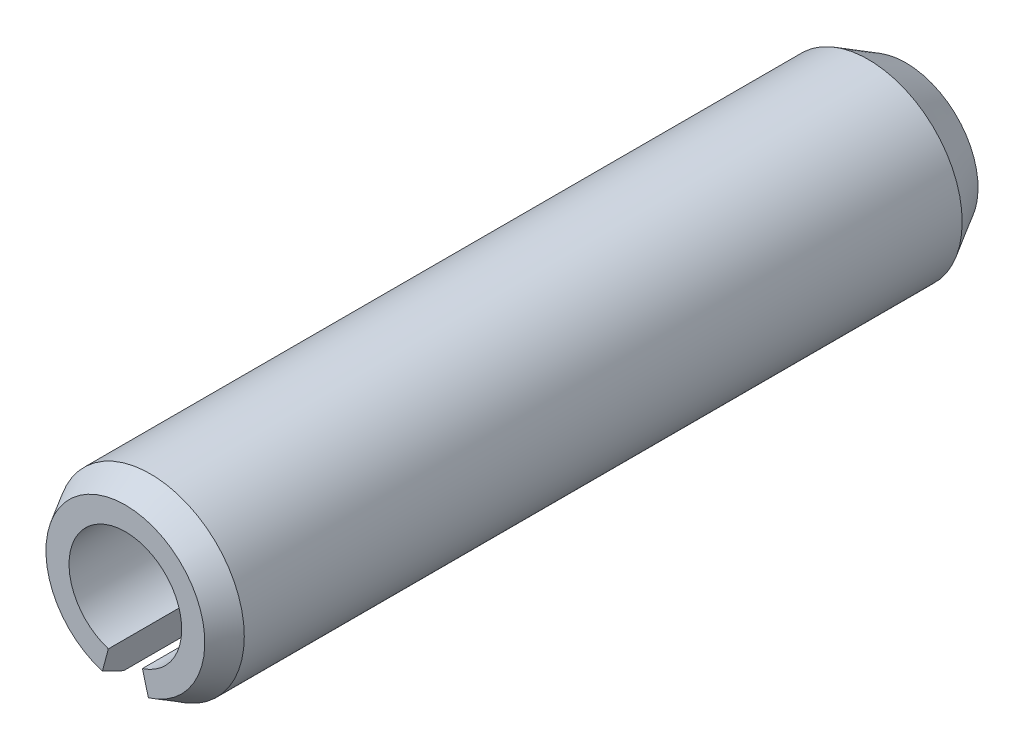
ISO-10303-21;
HEADER;
FILE_DESCRIPTION(('STEP AP214'),'2;1');
FILE_NAME('part.step','',(''),(''),'','','');
FILE_SCHEMA(('AUTOMOTIVE_DESIGN { 1 0 10303 214 1 1 1 1 }'));
ENDSEC;
DATA;
#1=APPLICATION_CONTEXT('core data for automotive mechanical design processes');
#2=APPLICATION_PROTOCOL_DEFINITION('international standard','automotive_design',2000,#1);
#3=PRODUCT_CONTEXT('',#1,'mechanical');
#4=PRODUCT('Part','Part','',(#3));
#5=PRODUCT_RELATED_PRODUCT_CATEGORY('part','',(#4));
#6=PRODUCT_DEFINITION_FORMATION('','',#4);
#7=PRODUCT_DEFINITION_CONTEXT('part definition',#1,'design');
#8=PRODUCT_DEFINITION('design','',#6,#7);
#9=PRODUCT_DEFINITION_SHAPE('','',#8);
#10=(LENGTH_UNIT() NAMED_UNIT(*) SI_UNIT(.MILLI.,.METRE.));
#11=(NAMED_UNIT(*) PLANE_ANGLE_UNIT() SI_UNIT($,.RADIAN.));
#12=(NAMED_UNIT(*) SI_UNIT($,.STERADIAN.) SOLID_ANGLE_UNIT());
#13=UNCERTAINTY_MEASURE_WITH_UNIT(LENGTH_MEASURE(1.E-05),#10,'distance_accuracy_value','');
#14=(GEOMETRIC_REPRESENTATION_CONTEXT(3) GLOBAL_UNCERTAINTY_ASSIGNED_CONTEXT((#13)) GLOBAL_UNIT_ASSIGNED_CONTEXT((#10,
#11,#12)) REPRESENTATION_CONTEXT('',''));
#15=CARTESIAN_POINT('',(0.,0.,0.));
#16=DIRECTION('',(0.,0.,1.));
#17=DIRECTION('',(1.,0.,0.));
#18=AXIS2_PLACEMENT_3D('',#15,#16,#17);
#19=CARTESIAN_POINT('',(0.,0.,25.));
#20=DIRECTION('',(0.,0.,-1.));
#21=DIRECTION('',(-1.,0.,0.));
#22=AXIS2_PLACEMENT_3D('',#19,#20,#21);
#23=CYLINDRICAL_SURFACE('',#22,3.);
#24=DIRECTION('',(0.,0.,-1.));
#25=VECTOR('',#24,1.);
#26=CARTESIAN_POINT('',(0.85488871162423,-2.8756156368224,25.));
#27=LINE('',#26,#25);
#28=CARTESIAN_POINT('',(0.85488871162423,-2.8756156368224,24.2));
#29=VERTEX_POINT('',#28);
#30=CARTESIAN_POINT('',(0.85488871162423,-2.8756156368224,1.26188021535174));
#31=VERTEX_POINT('',#30);
#32=EDGE_CURVE('E125',#29,#31,#27,.T.);
#33=ORIENTED_EDGE('',*,*,#32,.T.);
#34=CARTESIAN_POINT('',(0.,0.,1.26188021535174));
#35=DIRECTION('',(0.,0.,-1.));
#36=DIRECTION('',(-1.,0.,0.));
#37=AXIS2_PLACEMENT_3D('',#34,#35,#36);
#38=CIRCLE('',#37,3.);
#39=CARTESIAN_POINT('',(-0.85488871162424,-2.87561563682241,1.26188021535174));
#40=VERTEX_POINT('',#39);
#41=EDGE_CURVE('E174',#31,#40,#38,.F.);
#42=ORIENTED_EDGE('',*,*,#41,.T.);
#43=DIRECTION('',(0.,0.,-1.));
#44=VECTOR('',#43,1.);
#45=CARTESIAN_POINT('',(-0.85488871162424,-2.87561563682241,25.));
#46=LINE('',#45,#44);
#47=CARTESIAN_POINT('',(-0.85488871162424,-2.87561563682241,24.2));
#48=VERTEX_POINT('',#47);
#49=EDGE_CURVE('E104',#48,#40,#46,.T.);
#50=ORIENTED_EDGE('',*,*,#49,.F.);
#51=CARTESIAN_POINT('',(0.,0.,24.2));
#52=DIRECTION('',(0.,0.,1.));
#53=DIRECTION('',(1.,0.,0.));
#54=AXIS2_PLACEMENT_3D('',#51,#52,#53);
#55=CIRCLE('',#54,3.);
#56=EDGE_CURVE('E139',#48,#29,#55,.F.);
#57=ORIENTED_EDGE('',*,*,#56,.T.);
#58=EDGE_LOOP('',(#33,#42,#50,#57));
#59=FACE_BOUND('',#58,.T.);
#60=ADVANCED_FACE('F30',(#59),#23,.T.);
#61=CARTESIAN_POINT('',(-0.544114673264127,-1.71579113598909,25.));
#62=DIRECTION('',(0.965925826289069,-0.258819045102521,0.));
#63=DIRECTION('',(0.258819045102521,0.965925826289069,0.));
#64=AXIS2_PLACEMENT_3D('',#61,#62,#63);
#65=PLANE('',#64);
#66=ORIENTED_EDGE('',*,*,#49,.T.);
#67=CARTESIAN_POINT('',(-0.85488871162424,-2.87561563682241,1.26188021535174));
#68=CARTESIAN_POINT('',(-0.824991324845767,-2.76403707035159,1.06187394169725));
#69=CARTESIAN_POINT('',(-0.795092532536618,-2.65245325836889,0.861870804879628));
#70=CARTESIAN_POINT('',(-0.735292136851209,-2.42927514335823,0.461870804879614));
#71=CARTESIAN_POINT('',(-0.70539053347495,-2.31768084033027,0.261873941697224));
#72=CARTESIAN_POINT('',(-0.675487524568013,-2.20608129179042,0.061880215351702));
#73=B_SPLINE_CURVE_WITH_KNOTS('',3,(#67,#68,#69,#70,#71,#72),.UNSPECIFIED.,.F.,.F.,(4,2,4),(0.,
0.692903497274497,1.38580699468237),.UNSPECIFIED.);
#74=CARTESIAN_POINT('',(-0.675487524568013,-2.20608129179042,0.061880215351702));
#75=VERTEX_POINT('',#74);
#76=EDGE_CURVE('E58',#40,#75,#73,.T.);
#77=ORIENTED_EDGE('',*,*,#76,.T.);
#78=CARTESIAN_POINT('',(-0.85488871162424,-2.87561563682241,0.46188021535171));
#79=CARTESIAN_POINT('',(-0.820363465807382,-2.74676566529007,0.384891229899427));
#80=CARTESIAN_POINT('',(-0.785837551663028,-2.61791319952558,0.307906719233972));
#81=CARTESIAN_POINT('',(-0.716784386707371,-2.36020327948764,0.153946647450066));
#82=CARTESIAN_POINT('',(-0.682257135896068,-2.23134582521419,0.0769710863316175));
#83=CARTESIAN_POINT('',(-0.647729216757268,-2.10248587670857,0.));
#84=B_SPLINE_CURVE_WITH_KNOTS('',3,(#78,#79,#80,#81,#82,#83),.UNSPECIFIED.,.F.,.F.,(4,2,4),(0.,
0.462054654853131,0.924109309866234),.UNSPECIFIED.);
#85=CARTESIAN_POINT('',(-0.647729216757268,-2.10248587670857,0.));
#86=VERTEX_POINT('',#85);
#87=EDGE_CURVE('E109',#75,#86,#84,.T.);
#88=ORIENTED_EDGE('',*,*,#87,.T.);
#89=DIRECTION('',(-0.258819045102521,-0.965925826289069,0.));
#90=VECTOR('',#89,1.);
#91=CARTESIAN_POINT('',(-0.544114673264127,-1.71579113598909,0.));
#92=LINE('',#91,#90);
#93=CARTESIAN_POINT('',(-0.544114673264109,-1.71579113598908,0.));
#94=VERTEX_POINT('',#93);
#95=EDGE_CURVE('E108',#94,#86,#92,.T.);
#96=ORIENTED_EDGE('',*,*,#95,.F.);
#97=DIRECTION('',(0.,0.,-1.));
#98=VECTOR('',#97,1.);
#99=CARTESIAN_POINT('',(-0.544114673264109,-1.71579113598908,25.));
#100=LINE('',#99,#98);
#101=CARTESIAN_POINT('',(-0.544114673264109,-1.71579113598908,25.));
#102=VERTEX_POINT('',#101);
#103=EDGE_CURVE('E94',#102,#94,#100,.T.);
#104=ORIENTED_EDGE('',*,*,#103,.F.);
#105=DIRECTION('',(-0.258819045102521,-0.965925826289069,0.));
#106=VECTOR('',#105,1.);
#107=CARTESIAN_POINT('',(-0.544114673264127,-1.71579113598909,25.));
#108=LINE('',#107,#106);
#109=CARTESIAN_POINT('',(-0.735293146523919,-2.42927891150812,25.));
#110=VERTEX_POINT('',#109);
#111=EDGE_CURVE('E117',#102,#110,#108,.T.);
#112=ORIENTED_EDGE('',*,*,#111,.T.);
#113=CARTESIAN_POINT('',(-0.735293146523919,-2.42927891150812,25.));
#114=CARTESIAN_POINT('',(-0.755226828903657,-2.50367242693122,24.866669095173));
#115=CARTESIAN_POINT('',(-0.775159967185426,-2.57806391175306,24.7333369760914));
#116=CARTESIAN_POINT('',(-0.815025155552199,-2.72684282019116,24.4666703094247));
#117=CARTESIAN_POINT('',(-0.834957205637204,-2.80123024380741,24.3333357618396));
#118=CARTESIAN_POINT('',(-0.85488871162424,-2.87561563682241,24.2));
#119=B_SPLINE_CURVE_WITH_KNOTS('',3,(#113,#114,#115,#116,#117,#118),.UNSPECIFIED.,.F.,.F.,(4,2,
4),(0.,0.46193061486643,0.923861229713709),.UNSPECIFIED.);
#120=EDGE_CURVE('E133',#110,#48,#119,.T.);
#121=ORIENTED_EDGE('',*,*,#120,.T.);
#122=EDGE_LOOP('',(#66,#77,#88,#96,#104,#112,#121));
#123=FACE_BOUND('',#122,.T.);
#124=ADVANCED_FACE('F32',(#123),#65,.T.);
#125=CARTESIAN_POINT('',(0.,0.,25.));
#126=DIRECTION('',(0.,0.,-1.));
#127=DIRECTION('',(-1.,0.,0.));
#128=AXIS2_PLACEMENT_3D('',#125,#126,#127);
#129=CYLINDRICAL_SURFACE('',#128,1.8);
#130=DIRECTION('',(0.,0.,-1.));
#131=VECTOR('',#130,1.);
#132=CARTESIAN_POINT('',(0.544114673264102,-1.71579113598908,25.));
#133=LINE('',#132,#131);
#134=CARTESIAN_POINT('',(0.544114673264102,-1.71579113598908,25.));
#135=VERTEX_POINT('',#134);
#136=CARTESIAN_POINT('',(0.544114673264102,-1.71579113598908,0.));
#137=VERTEX_POINT('',#136);
#138=EDGE_CURVE('E105',#135,#137,#133,.T.);
#139=ORIENTED_EDGE('',*,*,#138,.F.);
#140=CARTESIAN_POINT('',(0.,0.,25.));
#141=DIRECTION('',(0.,0.,1.));
#142=DIRECTION('',(1.,0.,0.));
#143=AXIS2_PLACEMENT_3D('',#140,#141,#142);
#144=CIRCLE('',#143,1.8);
#145=EDGE_CURVE('E101',#135,#102,#144,.T.);
#146=ORIENTED_EDGE('',*,*,#145,.T.);
#147=ORIENTED_EDGE('',*,*,#103,.T.);
#148=CARTESIAN_POINT('',(0.,0.,0.));
#149=DIRECTION('',(0.,0.,1.));
#150=DIRECTION('',(1.,0.,0.));
#151=AXIS2_PLACEMENT_3D('',#148,#149,#150);
#152=CIRCLE('',#151,1.8);
#153=EDGE_CURVE('E98',#137,#94,#152,.T.);
#154=ORIENTED_EDGE('',*,*,#153,.F.);
#155=EDGE_LOOP('',(#139,#146,#147,#154));
#156=FACE_BOUND('',#155,.T.);
#157=ADVANCED_FACE('F96',(#156),#129,.F.);
#158=CARTESIAN_POINT('',(0.544114673264102,-1.71579113598908,25.));
#159=DIRECTION('',(0.965925826289068,0.258819045102521,0.));
#160=DIRECTION('',(-0.258819045102521,0.965925826289068,0.));
#161=AXIS2_PLACEMENT_3D('',#158,#159,#160);
#162=PLANE('',#161);
#163=CARTESIAN_POINT('',(0.647729216757258,-2.10248587670857,0.));
#164=CARTESIAN_POINT('',(0.68225713589605,-2.23134582521419,0.0769710863316155));
#165=CARTESIAN_POINT('',(0.716784386707349,-2.36020327948764,0.153946647450063));
#166=CARTESIAN_POINT('',(0.785837551663006,-2.61791319952558,0.307906719233969));
#167=CARTESIAN_POINT('',(0.820363465807364,-2.74676566529007,0.384891229899425));
#168=CARTESIAN_POINT('',(0.85488871162423,-2.8756156368224,0.46188021535171));
#169=B_SPLINE_CURVE_WITH_KNOTS('',3,(#163,#164,#165,#166,#167,#168),.UNSPECIFIED.,.F.,.F.,(4,2,
4),(0.,0.4620546550131,0.924109309866228),.UNSPECIFIED.);
#170=CARTESIAN_POINT('',(0.647729216757258,-2.10248587670857,0.));
#171=VERTEX_POINT('',#170);
#172=CARTESIAN_POINT('',(0.675487524568009,-2.20608129179042,0.061880215351702));
#173=VERTEX_POINT('',#172);
#174=EDGE_CURVE('E169',#171,#173,#169,.T.);
#175=ORIENTED_EDGE('',*,*,#174,.T.);
#176=CARTESIAN_POINT('',(0.675487524568009,-2.20608129179042,0.061880215351702));
#177=CARTESIAN_POINT('',(0.705390533474936,-2.31768084033027,0.261873941697223));
#178=CARTESIAN_POINT('',(0.735292136851189,-2.42927514335824,0.461870804879611));
#179=CARTESIAN_POINT('',(0.795092532536595,-2.6524532583689,0.861870804879625));
#180=CARTESIAN_POINT('',(0.824991324845749,-2.76403707035159,1.06187394169725));
#181=CARTESIAN_POINT('',(0.85488871162423,-2.8756156368224,1.26188021535174));
#182=B_SPLINE_CURVE_WITH_KNOTS('',3,(#176,#177,#178,#179,#180,#181),.UNSPECIFIED.,.F.,.F.,(4,2,
4),(0.,0.692903497407875,1.38580699468237),.UNSPECIFIED.);
#183=EDGE_CURVE('E11',#173,#31,#182,.T.);
#184=ORIENTED_EDGE('',*,*,#183,.T.);
#185=ORIENTED_EDGE('',*,*,#32,.F.);
#186=CARTESIAN_POINT('',(0.85488871162423,-2.8756156368224,24.2));
#187=CARTESIAN_POINT('',(0.834957205637186,-2.80123024380741,24.3333357618396));
#188=CARTESIAN_POINT('',(0.815025155552177,-2.72684282019116,24.4666703094247));
#189=CARTESIAN_POINT('',(0.775159967185405,-2.57806391175307,24.7333369760914));
#190=CARTESIAN_POINT('',(0.755226828903641,-2.50367242693122,24.866669095173));
#191=CARTESIAN_POINT('',(0.735293146523913,-2.42927891150811,25.));
#192=B_SPLINE_CURVE_WITH_KNOTS('',3,(#186,#187,#188,#189,#190,#191),.UNSPECIFIED.,.F.,.F.,(4,2,
4),(0.,0.461930614847278,0.923861229713708),.UNSPECIFIED.);
#193=CARTESIAN_POINT('',(0.735293146523913,-2.42927891150811,25.));
#194=VERTEX_POINT('',#193);
#195=EDGE_CURVE('E151',#29,#194,#192,.T.);
#196=ORIENTED_EDGE('',*,*,#195,.T.);
#197=DIRECTION('',(0.258819045102521,-0.965925826289068,0.));
#198=VECTOR('',#197,1.);
#199=CARTESIAN_POINT('',(0.544114673264102,-1.71579113598908,25.));
#200=LINE('',#199,#198);
#201=EDGE_CURVE('E122',#135,#194,#200,.T.);
#202=ORIENTED_EDGE('',*,*,#201,.F.);
#203=ORIENTED_EDGE('',*,*,#138,.T.);
#204=DIRECTION('',(0.258819045102521,-0.965925826289068,0.));
#205=VECTOR('',#204,1.);
#206=CARTESIAN_POINT('',(0.544114673264102,-1.71579113598908,0.));
#207=LINE('',#206,#205);
#208=EDGE_CURVE('E115',#137,#171,#207,.T.);
#209=ORIENTED_EDGE('',*,*,#208,.T.);
#210=EDGE_LOOP('',(#175,#184,#185,#196,#202,#203,#209));
#211=FACE_BOUND('',#210,.T.);
#212=ADVANCED_FACE('F160',(#211),#162,.F.);
#213=CARTESIAN_POINT('',(0.,0.,25.));
#214=DIRECTION('',(0.,0.,1.));
#215=DIRECTION('',(1.,0.,0.));
#216=AXIS2_PLACEMENT_3D('',#213,#214,#215);
#217=PLANE('',#216);
#218=ORIENTED_EDGE('',*,*,#201,.T.);
#219=CARTESIAN_POINT('',(0.,0.,25.));
#220=DIRECTION('',(0.,0.,1.));
#221=DIRECTION('',(1.,0.,0.));
#222=AXIS2_PLACEMENT_3D('',#219,#220,#221);
#223=CIRCLE('',#222,2.53811978464829);
#224=EDGE_CURVE('E130',#194,#110,#223,.T.);
#225=ORIENTED_EDGE('',*,*,#224,.T.);
#226=ORIENTED_EDGE('',*,*,#111,.F.);
#227=ORIENTED_EDGE('',*,*,#145,.F.);
#228=EDGE_LOOP('',(#218,#225,#226,#227));
#229=FACE_BOUND('',#228,.T.);
#230=ADVANCED_FACE('F164',(#229),#217,.T.);
#231=CARTESIAN_POINT('',(0.,0.,0.));
#232=DIRECTION('',(0.,0.,1.));
#233=DIRECTION('',(1.,0.,0.));
#234=AXIS2_PLACEMENT_3D('',#231,#232,#233);
#235=PLANE('',#234);
#236=ORIENTED_EDGE('',*,*,#95,.T.);
#237=CARTESIAN_POINT('',(0.,0.,0.));
#238=DIRECTION('',(0.,0.,1.));
#239=DIRECTION('',(1.,0.,0.));
#240=AXIS2_PLACEMENT_3D('',#237,#238,#239);
#241=CIRCLE('',#240,2.2);
#242=EDGE_CURVE('E175',#86,#171,#241,.F.);
#243=ORIENTED_EDGE('',*,*,#242,.T.);
#244=ORIENTED_EDGE('',*,*,#208,.F.);
#245=ORIENTED_EDGE('',*,*,#153,.T.);
#246=EDGE_LOOP('',(#236,#243,#244,#245));
#247=FACE_BOUND('',#246,.T.);
#248=ADVANCED_FACE('F113',(#247),#235,.F.);
#249=CARTESIAN_POINT('',(0.,0.,25.));
#250=DIRECTION('',(0.,0.,-1.));
#251=DIRECTION('',(-1.,0.,0.));
#252=AXIS2_PLACEMENT_3D('',#249,#250,#251);
#253=CONICAL_SURFACE('',#252,2.53811978464829,0.523598775598306);
#254=ORIENTED_EDGE('',*,*,#195,.F.);
#255=ORIENTED_EDGE('',*,*,#56,.F.);
#256=ORIENTED_EDGE('',*,*,#120,.F.);
#257=ORIENTED_EDGE('',*,*,#224,.F.);
#258=EDGE_LOOP('',(#254,#255,#256,#257));
#259=FACE_BOUND('',#258,.T.);
#260=ADVANCED_FACE('F141',(#259),#253,.T.);
#261=CARTESIAN_POINT('',(0.,0.,0.46188021535171));
#262=DIRECTION('',(0.,0.,1.));
#263=DIRECTION('',(1.,0.,0.));
#264=AXIS2_PLACEMENT_3D('',#261,#262,#263);
#265=CONICAL_SURFACE('',#264,3.,1.04719755119659);
#266=ORIENTED_EDGE('',*,*,#87,.F.);
#267=CARTESIAN_POINT('',(0.,0.,0.061880215351702));
#268=DIRECTION('',(0.,0.,1.));
#269=DIRECTION('',(1.,0.,0.));
#270=AXIS2_PLACEMENT_3D('',#267,#268,#269);
#271=CIRCLE('',#270,2.30717967697245);
#272=EDGE_CURVE('E44',#75,#173,#271,.F.);
#273=ORIENTED_EDGE('',*,*,#272,.T.);
#274=ORIENTED_EDGE('',*,*,#174,.F.);
#275=ORIENTED_EDGE('',*,*,#242,.F.);
#276=EDGE_LOOP('',(#266,#273,#274,#275));
#277=FACE_BOUND('',#276,.T.);
#278=ADVANCED_FACE('F146',(#277),#265,.T.);
#279=CARTESIAN_POINT('',(0.,0.,1.26188021535174));
#280=DIRECTION('',(0.,0.,1.));
#281=DIRECTION('',(1.,0.,0.));
#282=AXIS2_PLACEMENT_3D('',#279,#280,#281);
#283=CONICAL_SURFACE('',#282,3.,0.523598775598287);
#284=ORIENTED_EDGE('',*,*,#183,.F.);
#285=ORIENTED_EDGE('',*,*,#272,.F.);
#286=ORIENTED_EDGE('',*,*,#76,.F.);
#287=ORIENTED_EDGE('',*,*,#41,.F.);
#288=EDGE_LOOP('',(#284,#285,#286,#287));
#289=FACE_BOUND('',#288,.T.);
#290=ADVANCED_FACE('F181',(#289),#283,.T.);
#291=CLOSED_SHELL('',(#60,#124,#157,#212,#230,#248,#260,#278,#290));
#292=MANIFOLD_SOLID_BREP('B2',#291);
#293=ADVANCED_BREP_SHAPE_REPRESENTATION('',(#18,#292),#14);
#294=SHAPE_DEFINITION_REPRESENTATION(#9,#293);
ENDSEC;
END-ISO-10303-21;
